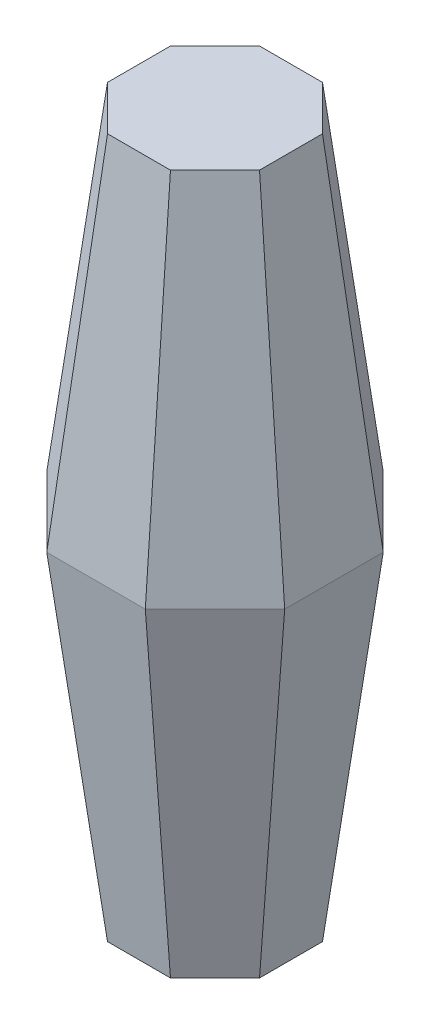
ISO-10303-21;
HEADER;
FILE_DESCRIPTION(('STEP AP214'),'2;1');
FILE_NAME('part.step','',(''),(''),'','','');
FILE_SCHEMA(('AUTOMOTIVE_DESIGN { 1 0 10303 214 1 1 1 1 }'));
ENDSEC;
DATA;
#1=APPLICATION_CONTEXT('core data for automotive mechanical design processes');
#2=APPLICATION_PROTOCOL_DEFINITION('international standard','automotive_design',2000,#1);
#3=PRODUCT_CONTEXT('',#1,'mechanical');
#4=PRODUCT('Part','Part','',(#3));
#5=PRODUCT_RELATED_PRODUCT_CATEGORY('part','',(#4));
#6=PRODUCT_DEFINITION_FORMATION('','',#4);
#7=PRODUCT_DEFINITION_CONTEXT('part definition',#1,'design');
#8=PRODUCT_DEFINITION('design','',#6,#7);
#9=PRODUCT_DEFINITION_SHAPE('','',#8);
#10=(LENGTH_UNIT() NAMED_UNIT(*) SI_UNIT(.MILLI.,.METRE.));
#11=(NAMED_UNIT(*) PLANE_ANGLE_UNIT() SI_UNIT($,.RADIAN.));
#12=(NAMED_UNIT(*) SI_UNIT($,.STERADIAN.) SOLID_ANGLE_UNIT());
#13=UNCERTAINTY_MEASURE_WITH_UNIT(LENGTH_MEASURE(1.E-05),#10,'distance_accuracy_value','');
#14=(GEOMETRIC_REPRESENTATION_CONTEXT(3) GLOBAL_UNCERTAINTY_ASSIGNED_CONTEXT((#13)) GLOBAL_UNIT_ASSIGNED_CONTEXT((#10,
#11,#12)) REPRESENTATION_CONTEXT('',''));
#15=CARTESIAN_POINT('',(0.,0.,0.));
#16=DIRECTION('',(0.,0.,1.));
#17=DIRECTION('',(1.,0.,0.));
#18=AXIS2_PLACEMENT_3D('',#15,#16,#17);
#19=CARTESIAN_POINT('',(-10.8639610306789,0.,4.5));
#20=DIRECTION('',(-0.70183611446619,-0.121869343405148,0.70183611446619));
#21=DIRECTION('',(0.707106781186548,0.,0.707106781186548));
#22=AXIS2_PLACEMENT_3D('',#19,#20,#21);
#23=PLANE('',#22);
#24=DIRECTION('',(0.707106781186547,0.,0.707106781186547));
#25=VECTOR('',#24,1.);
#26=CARTESIAN_POINT('',(-10.8639610306789,0.,4.5));
#27=LINE('',#26,#25);
#28=CARTESIAN_POINT('',(-10.8639610306789,0.,4.5));
#29=VERTEX_POINT('',#28);
#30=CARTESIAN_POINT('',(-4.5,0.,10.8639610306789));
#31=VERTEX_POINT('',#30);
#32=EDGE_CURVE('E141',#29,#31,#27,.T.);
#33=ORIENTED_EDGE('',*,*,#32,.T.);
#34=DIRECTION('',(0.0504157404498517,-0.991283948536189,-0.121714364351114));
#35=VECTOR('',#34,1.);
#36=CARTESIAN_POINT('',(-4.5,0.,10.8639610306789));
#37=LINE('',#36,#35);
#38=CARTESIAN_POINT('',(-7.04295151880042,50.,17.0031890758242));
#39=VERTEX_POINT('',#38);
#40=EDGE_CURVE('E11',#39,#31,#37,.T.);
#41=ORIENTED_EDGE('',*,*,#40,.F.);
#42=DIRECTION('',(-0.707106781186548,0.,-0.707106781186548));
#43=VECTOR('',#42,1.);
#44=CARTESIAN_POINT('',(-15.2050508126518,50.,8.84108978197284));
#45=LINE('',#44,#43);
#46=CARTESIAN_POINT('',(-17.0031890758242,50.,7.04295151880043));
#47=VERTEX_POINT('',#46);
#48=EDGE_CURVE('E200',#47,#39,#45,.F.);
#49=ORIENTED_EDGE('',*,*,#48,.F.);
#50=DIRECTION('',(0.121714364351114,-0.991283948536189,-0.0504157404498517));
#51=VECTOR('',#50,1.);
#52=CARTESIAN_POINT('',(-10.8639610306789,0.,4.5));
#53=LINE('',#52,#51);
#54=EDGE_CURVE('E202',#47,#29,#53,.T.);
#55=ORIENTED_EDGE('',*,*,#54,.T.);
#56=EDGE_LOOP('',(#33,#41,#49,#55));
#57=FACE_BOUND('',#56,.T.);
#58=ADVANCED_FACE('F39',(#57),#23,.T.);
#59=CARTESIAN_POINT('',(-4.5,0.,10.8639610306789));
#60=DIRECTION('',(0.,-0.121869343405148,0.992546151641322));
#61=DIRECTION('',(0.,-0.992546151641322,-0.121869343405148));
#62=AXIS2_PLACEMENT_3D('',#59,#60,#61);
#63=PLANE('',#62);
#64=DIRECTION('',(1.,0.,0.));
#65=VECTOR('',#64,1.);
#66=CARTESIAN_POINT('',(-4.5,0.,10.8639610306789));
#67=LINE('',#66,#65);
#68=CARTESIAN_POINT('',(4.5,0.,10.8639610306789));
#69=VERTEX_POINT('',#68);
#70=EDGE_CURVE('E187',#31,#69,#67,.T.);
#71=ORIENTED_EDGE('',*,*,#70,.T.);
#72=DIRECTION('',(-0.0504157404498516,-0.991283948536189,-0.121714364351114));
#73=VECTOR('',#72,1.);
#74=CARTESIAN_POINT('',(4.5,0.,10.8639610306789));
#75=LINE('',#74,#73);
#76=CARTESIAN_POINT('',(7.04295151880042,50.,17.0031890758242));
#77=VERTEX_POINT('',#76);
#78=EDGE_CURVE('E48',#77,#69,#75,.T.);
#79=ORIENTED_EDGE('',*,*,#78,.F.);
#80=DIRECTION('',(-1.,0.,0.));
#81=VECTOR('',#80,1.);
#82=CARTESIAN_POINT('',(-4.5,50.,17.0031890758242));
#83=LINE('',#82,#81);
#84=EDGE_CURVE('E219',#39,#77,#83,.F.);
#85=ORIENTED_EDGE('',*,*,#84,.F.);
#86=ORIENTED_EDGE('',*,*,#40,.T.);
#87=EDGE_LOOP('',(#71,#79,#85,#86));
#88=FACE_BOUND('',#87,.T.);
#89=ADVANCED_FACE('F41',(#88),#63,.T.);
#90=CARTESIAN_POINT('',(4.5,0.,10.8639610306789));
#91=DIRECTION('',(0.70183611446619,-0.121869343405148,0.70183611446619));
#92=DIRECTION('',(0.707106781186548,0.,-0.707106781186547));
#93=AXIS2_PLACEMENT_3D('',#90,#91,#92);
#94=PLANE('',#93);
#95=DIRECTION('',(0.707106781186548,0.,-0.707106781186547));
#96=VECTOR('',#95,1.);
#97=CARTESIAN_POINT('',(4.5,0.,10.8639610306789));
#98=LINE('',#97,#96);
#99=CARTESIAN_POINT('',(10.8639610306789,0.,4.5));
#100=VERTEX_POINT('',#99);
#101=EDGE_CURVE('E189',#69,#100,#98,.T.);
#102=ORIENTED_EDGE('',*,*,#101,.T.);
#103=DIRECTION('',(-0.121714364351114,-0.991283948536189,-0.0504157404498517));
#104=VECTOR('',#103,1.);
#105=CARTESIAN_POINT('',(10.8087341524596,-0.449786828353541,4.47712427803404));
#106=LINE('',#105,#104);
#107=CARTESIAN_POINT('',(17.0031890758242,50.,7.04295151880042));
#108=VERTEX_POINT('',#107);
#109=EDGE_CURVE('E213',#108,#100,#106,.T.);
#110=ORIENTED_EDGE('',*,*,#109,.F.);
#111=DIRECTION('',(-0.707106781186548,0.,0.707106781186547));
#112=VECTOR('',#111,1.);
#113=CARTESIAN_POINT('',(8.84108978197283,50.,15.2050508126518));
#114=LINE('',#113,#112);
#115=EDGE_CURVE('E222',#77,#108,#114,.F.);
#116=ORIENTED_EDGE('',*,*,#115,.F.);
#117=ORIENTED_EDGE('',*,*,#78,.T.);
#118=EDGE_LOOP('',(#102,#110,#116,#117));
#119=FACE_BOUND('',#118,.T.);
#120=ADVANCED_FACE('F281',(#119),#94,.T.);
#121=CARTESIAN_POINT('',(10.8639610306789,0.,-4.5));
#122=DIRECTION('',(0.992546151641322,-0.121869343405148,0.));
#123=DIRECTION('',(0.121869343405148,0.992546151641322,0.));
#124=AXIS2_PLACEMENT_3D('',#121,#122,#123);
#125=PLANE('',#124);
#126=DIRECTION('',(0.,0.,-1.));
#127=VECTOR('',#126,1.);
#128=CARTESIAN_POINT('',(10.8639610306789,0.,-4.5));
#129=LINE('',#128,#127);
#130=CARTESIAN_POINT('',(10.8639610306789,0.,-4.5));
#131=VERTEX_POINT('',#130);
#132=EDGE_CURVE('E191',#100,#131,#129,.T.);
#133=ORIENTED_EDGE('',*,*,#132,.T.);
#134=DIRECTION('',(-0.121714364351114,-0.991283948536189,0.0504157404498517));
#135=VECTOR('',#134,1.);
#136=CARTESIAN_POINT('',(10.8087341524596,-0.449786828353541,-4.47712427803404));
#137=LINE('',#136,#135);
#138=CARTESIAN_POINT('',(17.0031890758242,50.,-7.04295151880042));
#139=VERTEX_POINT('',#138);
#140=EDGE_CURVE('E210',#139,#131,#137,.T.);
#141=ORIENTED_EDGE('',*,*,#140,.F.);
#142=DIRECTION('',(0.,0.,1.));
#143=VECTOR('',#142,1.);
#144=CARTESIAN_POINT('',(17.0031890758242,50.,-4.5));
#145=LINE('',#144,#143);
#146=EDGE_CURVE('E225',#108,#139,#145,.F.);
#147=ORIENTED_EDGE('',*,*,#146,.F.);
#148=ORIENTED_EDGE('',*,*,#109,.T.);
#149=EDGE_LOOP('',(#133,#141,#147,#148));
#150=FACE_BOUND('',#149,.T.);
#151=ADVANCED_FACE('F279',(#150),#125,.T.);
#152=CARTESIAN_POINT('',(4.5,0.,-10.8639610306789));
#153=DIRECTION('',(0.70183611446619,-0.121869343405148,-0.70183611446619));
#154=DIRECTION('',(-0.707106781186548,0.,-0.707106781186547));
#155=AXIS2_PLACEMENT_3D('',#152,#153,#154);
#156=PLANE('',#155);
#157=DIRECTION('',(-0.707106781186548,0.,-0.707106781186547));
#158=VECTOR('',#157,1.);
#159=CARTESIAN_POINT('',(4.5,0.,-10.8639610306789));
#160=LINE('',#159,#158);
#161=CARTESIAN_POINT('',(4.5,0.,-10.8639610306789));
#162=VERTEX_POINT('',#161);
#163=EDGE_CURVE('E193',#131,#162,#160,.T.);
#164=ORIENTED_EDGE('',*,*,#163,.T.);
#165=DIRECTION('',(-0.0504157404498516,-0.991283948536189,0.121714364351114));
#166=VECTOR('',#165,1.);
#167=CARTESIAN_POINT('',(4.47712427803404,-0.449786828353541,-10.8087341524596));
#168=LINE('',#167,#166);
#169=CARTESIAN_POINT('',(7.04295151880042,50.,-17.0031890758242));
#170=VERTEX_POINT('',#169);
#171=EDGE_CURVE('E207',#170,#162,#168,.T.);
#172=ORIENTED_EDGE('',*,*,#171,.F.);
#173=DIRECTION('',(0.707106781186548,0.,0.707106781186547));
#174=VECTOR('',#173,1.);
#175=CARTESIAN_POINT('',(8.84108978197283,50.,-15.2050508126518));
#176=LINE('',#175,#174);
#177=EDGE_CURVE('E228',#139,#170,#176,.F.);
#178=ORIENTED_EDGE('',*,*,#177,.F.);
#179=ORIENTED_EDGE('',*,*,#140,.T.);
#180=EDGE_LOOP('',(#164,#172,#178,#179));
#181=FACE_BOUND('',#180,.T.);
#182=ADVANCED_FACE('F275',(#181),#156,.T.);
#183=CARTESIAN_POINT('',(-4.5,0.,-10.8639610306789));
#184=DIRECTION('',(0.,-0.121869343405148,-0.992546151641322));
#185=DIRECTION('',(0.,0.992546151641322,-0.121869343405148));
#186=AXIS2_PLACEMENT_3D('',#183,#184,#185);
#187=PLANE('',#186);
#188=DIRECTION('',(-1.,0.,0.));
#189=VECTOR('',#188,1.);
#190=CARTESIAN_POINT('',(-4.5,0.,-10.8639610306789));
#191=LINE('',#190,#189);
#192=CARTESIAN_POINT('',(-4.5,0.,-10.8639610306789));
#193=VERTEX_POINT('',#192);
#194=EDGE_CURVE('E195',#162,#193,#191,.T.);
#195=ORIENTED_EDGE('',*,*,#194,.T.);
#196=DIRECTION('',(0.0504157404498517,-0.991283948536189,0.121714364351114));
#197=VECTOR('',#196,1.);
#198=CARTESIAN_POINT('',(-4.5,0.,-10.8639610306789));
#199=LINE('',#198,#197);
#200=CARTESIAN_POINT('',(-7.04295151880043,50.,-17.0031890758242));
#201=VERTEX_POINT('',#200);
#202=EDGE_CURVE('E64',#201,#193,#199,.T.);
#203=ORIENTED_EDGE('',*,*,#202,.F.);
#204=DIRECTION('',(1.,0.,0.));
#205=VECTOR('',#204,1.);
#206=CARTESIAN_POINT('',(-4.5,50.,-17.0031890758242));
#207=LINE('',#206,#205);
#208=EDGE_CURVE('E231',#170,#201,#207,.F.);
#209=ORIENTED_EDGE('',*,*,#208,.F.);
#210=ORIENTED_EDGE('',*,*,#171,.T.);
#211=EDGE_LOOP('',(#195,#203,#209,#210));
#212=FACE_BOUND('',#211,.T.);
#213=ADVANCED_FACE('F272',(#212),#187,.T.);
#214=CARTESIAN_POINT('',(-4.5,0.,-10.8639610306789));
#215=DIRECTION('',(-0.70183611446619,-0.121869343405148,-0.70183611446619));
#216=DIRECTION('',(-0.707106781186547,0.,0.707106781186548));
#217=AXIS2_PLACEMENT_3D('',#214,#215,#216);
#218=PLANE('',#217);
#219=DIRECTION('',(-0.707106781186547,0.,0.707106781186548));
#220=VECTOR('',#219,1.);
#221=CARTESIAN_POINT('',(-4.5,0.,-10.8639610306789));
#222=LINE('',#221,#220);
#223=CARTESIAN_POINT('',(-10.8639610306789,0.,-4.5));
#224=VERTEX_POINT('',#223);
#225=EDGE_CURVE('E197',#193,#224,#222,.T.);
#226=ORIENTED_EDGE('',*,*,#225,.T.);
#227=DIRECTION('',(0.121714364351114,-0.991283948536189,0.0504157404498517));
#228=VECTOR('',#227,1.);
#229=CARTESIAN_POINT('',(-10.8639610306789,0.,-4.5));
#230=LINE('',#229,#228);
#231=CARTESIAN_POINT('',(-17.0031890758242,50.,-7.04295151880042));
#232=VERTEX_POINT('',#231);
#233=EDGE_CURVE('E56',#232,#224,#230,.T.);
#234=ORIENTED_EDGE('',*,*,#233,.F.);
#235=DIRECTION('',(0.707106781186547,0.,-0.707106781186548));
#236=VECTOR('',#235,1.);
#237=CARTESIAN_POINT('',(-8.84108978197283,50.,-15.2050508126518));
#238=LINE('',#237,#236);
#239=EDGE_CURVE('E233',#201,#232,#238,.F.);
#240=ORIENTED_EDGE('',*,*,#239,.F.);
#241=ORIENTED_EDGE('',*,*,#202,.T.);
#242=EDGE_LOOP('',(#226,#234,#240,#241));
#243=FACE_BOUND('',#242,.T.);
#244=ADVANCED_FACE('F238',(#243),#218,.T.);
#245=CARTESIAN_POINT('',(-10.8639610306789,0.,-4.5));
#246=DIRECTION('',(-0.992546151641322,-0.121869343405148,0.));
#247=DIRECTION('',(0.121869343405148,-0.992546151641322,0.));
#248=AXIS2_PLACEMENT_3D('',#245,#246,#247);
#249=PLANE('',#248);
#250=DIRECTION('',(0.,0.,1.));
#251=VECTOR('',#250,1.);
#252=CARTESIAN_POINT('',(-10.8639610306789,0.,-4.5));
#253=LINE('',#252,#251);
#254=EDGE_CURVE('E199',#224,#29,#253,.T.);
#255=ORIENTED_EDGE('',*,*,#254,.T.);
#256=ORIENTED_EDGE('',*,*,#54,.F.);
#257=DIRECTION('',(0.,0.,-1.));
#258=VECTOR('',#257,1.);
#259=CARTESIAN_POINT('',(-17.0031890758242,50.,-4.5));
#260=LINE('',#259,#258);
#261=EDGE_CURVE('E43',#232,#47,#260,.F.);
#262=ORIENTED_EDGE('',*,*,#261,.F.);
#263=ORIENTED_EDGE('',*,*,#233,.T.);
#264=EDGE_LOOP('',(#255,#256,#262,#263));
#265=FACE_BOUND('',#264,.T.);
#266=ADVANCED_FACE('F248',(#265),#249,.T.);
#267=CARTESIAN_POINT('',(0.,0.,0.));
#268=DIRECTION('',(0.,1.,0.));
#269=DIRECTION('',(0.,0.,1.));
#270=AXIS2_PLACEMENT_3D('',#267,#268,#269);
#271=PLANE('',#270);
#272=ORIENTED_EDGE('',*,*,#32,.F.);
#273=ORIENTED_EDGE('',*,*,#254,.F.);
#274=ORIENTED_EDGE('',*,*,#225,.F.);
#275=ORIENTED_EDGE('',*,*,#194,.F.);
#276=ORIENTED_EDGE('',*,*,#163,.F.);
#277=ORIENTED_EDGE('',*,*,#132,.F.);
#278=ORIENTED_EDGE('',*,*,#101,.F.);
#279=ORIENTED_EDGE('',*,*,#70,.F.);
#280=EDGE_LOOP('',(#272,#273,#274,#275,#276,#277,#278,#279));
#281=FACE_BOUND('',#280,.T.);
#282=ADVANCED_FACE('F244',(#281),#271,.F.);
#283=CARTESIAN_POINT('',(-10.8639610306789,100.,4.5));
#284=DIRECTION('',(-0.70183611446619,0.121869343405148,0.70183611446619));
#285=DIRECTION('',(0.707106781186548,0.,0.707106781186548));
#286=AXIS2_PLACEMENT_3D('',#283,#284,#285);
#287=PLANE('',#286);
#288=DIRECTION('',(0.707106781186547,0.,0.707106781186547));
#289=VECTOR('',#288,1.);
#290=CARTESIAN_POINT('',(-10.8639610306789,100.,4.5));
#291=LINE('',#290,#289);
#292=CARTESIAN_POINT('',(-10.8639610306789,100.,4.5));
#293=VERTEX_POINT('',#292);
#294=CARTESIAN_POINT('',(-4.5,100.,10.8639610306789));
#295=VERTEX_POINT('',#294);
#296=EDGE_CURVE('E145',#293,#295,#291,.T.);
#297=ORIENTED_EDGE('',*,*,#296,.F.);
#298=DIRECTION('',(0.121714364351114,0.991283948536189,-0.0504157404498517));
#299=VECTOR('',#298,1.);
#300=CARTESIAN_POINT('',(-10.8087341524596,100.449786828354,4.47712427803404));
#301=LINE('',#300,#299);
#302=EDGE_CURVE('E132',#47,#293,#301,.T.);
#303=ORIENTED_EDGE('',*,*,#302,.F.);
#304=ORIENTED_EDGE('',*,*,#48,.T.);
#305=DIRECTION('',(0.0504157404498517,0.991283948536189,-0.121714364351114));
#306=VECTOR('',#305,1.);
#307=CARTESIAN_POINT('',(-4.47712427803404,100.449786828354,10.8087341524596));
#308=LINE('',#307,#306);
#309=EDGE_CURVE('E148',#39,#295,#308,.T.);
#310=ORIENTED_EDGE('',*,*,#309,.T.);
#311=EDGE_LOOP('',(#297,#303,#304,#310));
#312=FACE_BOUND('',#311,.T.);
#313=ADVANCED_FACE('F146',(#312),#287,.T.);
#314=CARTESIAN_POINT('',(-10.8639610306789,100.,-4.5));
#315=DIRECTION('',(-0.992546151641322,0.121869343405148,0.));
#316=DIRECTION('',(-0.121869343405148,-0.992546151641322,0.));
#317=AXIS2_PLACEMENT_3D('',#314,#315,#316);
#318=PLANE('',#317);
#319=DIRECTION('',(0.,0.,1.));
#320=VECTOR('',#319,1.);
#321=CARTESIAN_POINT('',(-10.8639610306789,100.,-4.5));
#322=LINE('',#321,#320);
#323=CARTESIAN_POINT('',(-10.8639610306789,100.,-4.5));
#324=VERTEX_POINT('',#323);
#325=EDGE_CURVE('E137',#324,#293,#322,.T.);
#326=ORIENTED_EDGE('',*,*,#325,.F.);
#327=DIRECTION('',(0.121714364351114,0.991283948536189,0.0504157404498517));
#328=VECTOR('',#327,1.);
#329=CARTESIAN_POINT('',(-10.8087341524596,100.449786828354,-4.47712427803404));
#330=LINE('',#329,#328);
#331=EDGE_CURVE('E142',#232,#324,#330,.T.);
#332=ORIENTED_EDGE('',*,*,#331,.F.);
#333=ORIENTED_EDGE('',*,*,#261,.T.);
#334=ORIENTED_EDGE('',*,*,#302,.T.);
#335=EDGE_LOOP('',(#326,#332,#333,#334));
#336=FACE_BOUND('',#335,.T.);
#337=ADVANCED_FACE('F134',(#336),#318,.T.);
#338=CARTESIAN_POINT('',(-4.5,100.,-10.8639610306789));
#339=DIRECTION('',(-0.70183611446619,0.121869343405148,-0.70183611446619));
#340=DIRECTION('',(-0.707106781186547,0.,0.707106781186548));
#341=AXIS2_PLACEMENT_3D('',#338,#339,#340);
#342=PLANE('',#341);
#343=DIRECTION('',(-0.707106781186547,0.,0.707106781186548));
#344=VECTOR('',#343,1.);
#345=CARTESIAN_POINT('',(-4.5,100.,-10.8639610306789));
#346=LINE('',#345,#344);
#347=CARTESIAN_POINT('',(-4.5,100.,-10.8639610306789));
#348=VERTEX_POINT('',#347);
#349=EDGE_CURVE('E156',#348,#324,#346,.T.);
#350=ORIENTED_EDGE('',*,*,#349,.F.);
#351=DIRECTION('',(0.0504157404498517,0.991283948536189,0.121714364351114));
#352=VECTOR('',#351,1.);
#353=CARTESIAN_POINT('',(-4.5,100.,-10.8639610306789));
#354=LINE('',#353,#352);
#355=EDGE_CURVE('E182',#201,#348,#354,.T.);
#356=ORIENTED_EDGE('',*,*,#355,.F.);
#357=ORIENTED_EDGE('',*,*,#239,.T.);
#358=ORIENTED_EDGE('',*,*,#331,.T.);
#359=EDGE_LOOP('',(#350,#356,#357,#358));
#360=FACE_BOUND('',#359,.T.);
#361=ADVANCED_FACE('F237',(#360),#342,.T.);
#362=CARTESIAN_POINT('',(-4.5,100.,-10.8639610306789));
#363=DIRECTION('',(0.,0.121869343405148,-0.992546151641322));
#364=DIRECTION('',(0.,0.992546151641322,0.121869343405148));
#365=AXIS2_PLACEMENT_3D('',#362,#363,#364);
#366=PLANE('',#365);
#367=DIRECTION('',(-1.,0.,0.));
#368=VECTOR('',#367,1.);
#369=CARTESIAN_POINT('',(-4.5,100.,-10.8639610306789));
#370=LINE('',#369,#368);
#371=CARTESIAN_POINT('',(4.5,100.,-10.8639610306789));
#372=VERTEX_POINT('',#371);
#373=EDGE_CURVE('E158',#372,#348,#370,.T.);
#374=ORIENTED_EDGE('',*,*,#373,.F.);
#375=DIRECTION('',(-0.0504157404498516,0.991283948536189,0.121714364351114));
#376=VECTOR('',#375,1.);
#377=CARTESIAN_POINT('',(4.5,100.,-10.8639610306789));
#378=LINE('',#377,#376);
#379=EDGE_CURVE('E180',#170,#372,#378,.T.);
#380=ORIENTED_EDGE('',*,*,#379,.F.);
#381=ORIENTED_EDGE('',*,*,#208,.T.);
#382=ORIENTED_EDGE('',*,*,#355,.T.);
#383=EDGE_LOOP('',(#374,#380,#381,#382));
#384=FACE_BOUND('',#383,.T.);
#385=ADVANCED_FACE('F271',(#384),#366,.T.);
#386=CARTESIAN_POINT('',(4.5,100.,-10.8639610306789));
#387=DIRECTION('',(0.70183611446619,0.121869343405148,-0.70183611446619));
#388=DIRECTION('',(-0.707106781186548,0.,-0.707106781186547));
#389=AXIS2_PLACEMENT_3D('',#386,#387,#388);
#390=PLANE('',#389);
#391=DIRECTION('',(-0.707106781186548,0.,-0.707106781186547));
#392=VECTOR('',#391,1.);
#393=CARTESIAN_POINT('',(4.5,100.,-10.8639610306789));
#394=LINE('',#393,#392);
#395=CARTESIAN_POINT('',(10.8639610306789,100.,-4.5));
#396=VERTEX_POINT('',#395);
#397=EDGE_CURVE('E162',#396,#372,#394,.T.);
#398=ORIENTED_EDGE('',*,*,#397,.F.);
#399=DIRECTION('',(-0.121714364351114,0.991283948536189,0.0504157404498517));
#400=VECTOR('',#399,1.);
#401=CARTESIAN_POINT('',(10.8639610306789,100.,-4.5));
#402=LINE('',#401,#400);
#403=EDGE_CURVE('E178',#139,#396,#402,.T.);
#404=ORIENTED_EDGE('',*,*,#403,.F.);
#405=ORIENTED_EDGE('',*,*,#177,.T.);
#406=ORIENTED_EDGE('',*,*,#379,.T.);
#407=EDGE_LOOP('',(#398,#404,#405,#406));
#408=FACE_BOUND('',#407,.T.);
#409=ADVANCED_FACE('F267',(#408),#390,.T.);
#410=CARTESIAN_POINT('',(10.8639610306789,100.,-4.5));
#411=DIRECTION('',(0.992546151641322,0.121869343405148,0.));
#412=DIRECTION('',(-0.121869343405148,0.992546151641322,0.));
#413=AXIS2_PLACEMENT_3D('',#410,#411,#412);
#414=PLANE('',#413);
#415=DIRECTION('',(0.,0.,-1.));
#416=VECTOR('',#415,1.);
#417=CARTESIAN_POINT('',(10.8639610306789,100.,-4.5));
#418=LINE('',#417,#416);
#419=CARTESIAN_POINT('',(10.8639610306789,100.,4.5));
#420=VERTEX_POINT('',#419);
#421=EDGE_CURVE('E165',#420,#396,#418,.T.);
#422=ORIENTED_EDGE('',*,*,#421,.F.);
#423=DIRECTION('',(-0.121714364351114,0.991283948536189,-0.0504157404498517));
#424=VECTOR('',#423,1.);
#425=CARTESIAN_POINT('',(10.8087341524596,100.449786828354,4.47712427803404));
#426=LINE('',#425,#424);
#427=EDGE_CURVE('E176',#108,#420,#426,.T.);
#428=ORIENTED_EDGE('',*,*,#427,.F.);
#429=ORIENTED_EDGE('',*,*,#146,.T.);
#430=ORIENTED_EDGE('',*,*,#403,.T.);
#431=EDGE_LOOP('',(#422,#428,#429,#430));
#432=FACE_BOUND('',#431,.T.);
#433=ADVANCED_FACE('F262',(#432),#414,.T.);
#434=CARTESIAN_POINT('',(4.5,100.,10.8639610306789));
#435=DIRECTION('',(0.70183611446619,0.121869343405148,0.70183611446619));
#436=DIRECTION('',(0.707106781186548,0.,-0.707106781186547));
#437=AXIS2_PLACEMENT_3D('',#434,#435,#436);
#438=PLANE('',#437);
#439=DIRECTION('',(0.707106781186548,0.,-0.707106781186547));
#440=VECTOR('',#439,1.);
#441=CARTESIAN_POINT('',(4.5,100.,10.8639610306789));
#442=LINE('',#441,#440);
#443=CARTESIAN_POINT('',(4.5,100.,10.8639610306789));
#444=VERTEX_POINT('',#443);
#445=EDGE_CURVE('E168',#444,#420,#442,.T.);
#446=ORIENTED_EDGE('',*,*,#445,.F.);
#447=DIRECTION('',(-0.0504157404498516,0.991283948536189,-0.121714364351114));
#448=VECTOR('',#447,1.);
#449=CARTESIAN_POINT('',(4.47712427803404,100.449786828354,10.8087341524596));
#450=LINE('',#449,#448);
#451=EDGE_CURVE('E174',#77,#444,#450,.T.);
#452=ORIENTED_EDGE('',*,*,#451,.F.);
#453=ORIENTED_EDGE('',*,*,#115,.T.);
#454=ORIENTED_EDGE('',*,*,#427,.T.);
#455=EDGE_LOOP('',(#446,#452,#453,#454));
#456=FACE_BOUND('',#455,.T.);
#457=ADVANCED_FACE('F258',(#456),#438,.T.);
#458=CARTESIAN_POINT('',(-4.5,100.,10.8639610306789));
#459=DIRECTION('',(0.,0.121869343405148,0.992546151641322));
#460=DIRECTION('',(0.,-0.992546151641322,0.121869343405148));
#461=AXIS2_PLACEMENT_3D('',#458,#459,#460);
#462=PLANE('',#461);
#463=DIRECTION('',(1.,0.,0.));
#464=VECTOR('',#463,1.);
#465=CARTESIAN_POINT('',(-4.5,100.,10.8639610306789));
#466=LINE('',#465,#464);
#467=EDGE_CURVE('E171',#295,#444,#466,.T.);
#468=ORIENTED_EDGE('',*,*,#467,.F.);
#469=ORIENTED_EDGE('',*,*,#309,.F.);
#470=ORIENTED_EDGE('',*,*,#84,.T.);
#471=ORIENTED_EDGE('',*,*,#451,.T.);
#472=EDGE_LOOP('',(#468,#469,#470,#471));
#473=FACE_BOUND('',#472,.T.);
#474=ADVANCED_FACE('F253',(#473),#462,.T.);
#475=CARTESIAN_POINT('',(0.,100.,0.));
#476=DIRECTION('',(0.,-1.,0.));
#477=DIRECTION('',(0.,0.,1.));
#478=AXIS2_PLACEMENT_3D('',#475,#476,#477);
#479=PLANE('',#478);
#480=ORIENTED_EDGE('',*,*,#296,.T.);
#481=ORIENTED_EDGE('',*,*,#467,.T.);
#482=ORIENTED_EDGE('',*,*,#445,.T.);
#483=ORIENTED_EDGE('',*,*,#421,.T.);
#484=ORIENTED_EDGE('',*,*,#397,.T.);
#485=ORIENTED_EDGE('',*,*,#373,.T.);
#486=ORIENTED_EDGE('',*,*,#349,.T.);
#487=ORIENTED_EDGE('',*,*,#325,.T.);
#488=EDGE_LOOP('',(#480,#481,#482,#483,#484,#485,#486,#487));
#489=FACE_BOUND('',#488,.T.);
#490=ADVANCED_FACE('F153',(#489),#479,.F.);
#491=CLOSED_SHELL('',(#58,#89,#120,#151,#182,#213,#244,#266,#282,#313,#337,#361,#385,#409,#433,
#457,#474,#490));
#492=MANIFOLD_SOLID_BREP('B2',#491);
#493=ADVANCED_BREP_SHAPE_REPRESENTATION('',(#18,#492),#14);
#494=SHAPE_DEFINITION_REPRESENTATION(#9,#493);
ENDSEC;
END-ISO-10303-21;
